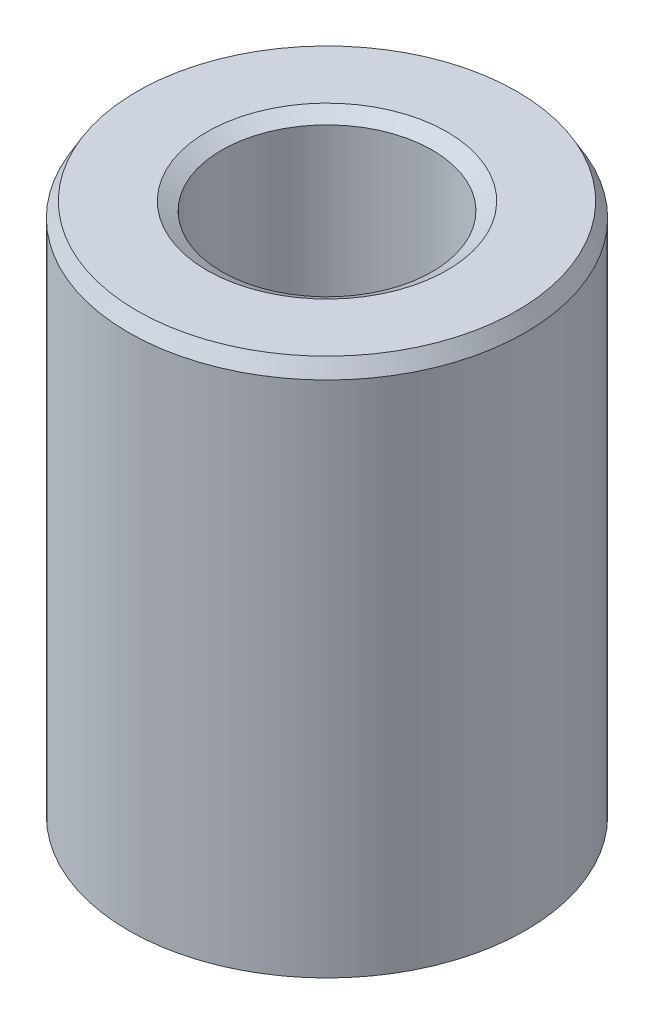
ISO-10303-21;
HEADER;
FILE_DESCRIPTION(('STEP AP214'),'2;1');
FILE_NAME('part.step','',(''),(''),'','','');
FILE_SCHEMA(('AUTOMOTIVE_DESIGN { 1 0 10303 214 1 1 1 1 }'));
ENDSEC;
DATA;
#1=APPLICATION_CONTEXT('core data for automotive mechanical design processes');
#2=APPLICATION_PROTOCOL_DEFINITION('international standard','automotive_design',2000,#1);
#3=PRODUCT_CONTEXT('',#1,'mechanical');
#4=PRODUCT('Part','Part','',(#3));
#5=PRODUCT_RELATED_PRODUCT_CATEGORY('part','',(#4));
#6=PRODUCT_DEFINITION_FORMATION('','',#4);
#7=PRODUCT_DEFINITION_CONTEXT('part definition',#1,'design');
#8=PRODUCT_DEFINITION('design','',#6,#7);
#9=PRODUCT_DEFINITION_SHAPE('','',#8);
#10=(LENGTH_UNIT() NAMED_UNIT(*) SI_UNIT(.MILLI.,.METRE.));
#11=(NAMED_UNIT(*) PLANE_ANGLE_UNIT() SI_UNIT($,.RADIAN.));
#12=(NAMED_UNIT(*) SI_UNIT($,.STERADIAN.) SOLID_ANGLE_UNIT());
#13=UNCERTAINTY_MEASURE_WITH_UNIT(LENGTH_MEASURE(1.E-05),#10,'distance_accuracy_value','');
#14=(GEOMETRIC_REPRESENTATION_CONTEXT(3) GLOBAL_UNCERTAINTY_ASSIGNED_CONTEXT((#13)) GLOBAL_UNIT_ASSIGNED_CONTEXT((#10,
#11,#12)) REPRESENTATION_CONTEXT('',''));
#15=CARTESIAN_POINT('',(0.,0.,0.));
#16=DIRECTION('',(0.,0.,1.));
#17=DIRECTION('',(1.,0.,0.));
#18=AXIS2_PLACEMENT_3D('',#15,#16,#17);
#19=CARTESIAN_POINT('',(0.,20.4448372051273,0.));
#20=DIRECTION('',(0.,-1.,0.));
#21=DIRECTION('',(0.,0.,-1.));
#22=AXIS2_PLACEMENT_3D('',#19,#20,#21);
#23=CYLINDRICAL_SURFACE('',#22,7.5);
#24=CARTESIAN_POINT('',(0.,0.319921037343789,0.));
#25=DIRECTION('',(0.,1.,0.));
#26=DIRECTION('',(0.,0.,1.));
#27=AXIS2_PLACEMENT_3D('',#24,#25,#26);
#28=CIRCLE('',#27,7.5);
#29=CARTESIAN_POINT('',(0.,0.319921037343789,7.5));
#30=VERTEX_POINT('',#29);
#31=EDGE_CURVE('E10',#30,#30,#28,.T.);
#32=ORIENTED_EDGE('',*,*,#31,.T.);
#33=EDGE_LOOP('',(#32));
#34=FACE_BOUND('',#33,.T.);
#35=CARTESIAN_POINT('',(0.,19.8907177140377,0.));
#36=DIRECTION('',(0.,1.,0.));
#37=DIRECTION('',(0.,0.,1.));
#38=AXIS2_PLACEMENT_3D('',#35,#36,#37);
#39=CIRCLE('',#38,7.5);
#40=CARTESIAN_POINT('',(0.,19.8907177140377,7.5));
#41=VERTEX_POINT('',#40);
#42=EDGE_CURVE('E50',#41,#41,#39,.F.);
#43=ORIENTED_EDGE('',*,*,#42,.T.);
#44=EDGE_LOOP('',(#43));
#45=FACE_BOUND('',#44,.T.);
#46=ADVANCED_FACE('F39',(#34,#45),#23,.T.);
#47=CARTESIAN_POINT('',(0.,20.4448372051273,0.));
#48=DIRECTION('',(0.,1.,0.));
#49=DIRECTION('',(0.,0.,1.));
#50=AXIS2_PLACEMENT_3D('',#47,#48,#49);
#51=PLANE('',#50);
#52=CARTESIAN_POINT('',(0.,20.4448372051273,0.));
#53=DIRECTION('',(0.,1.,0.));
#54=DIRECTION('',(0.,0.,1.));
#55=AXIS2_PLACEMENT_3D('',#52,#53,#54);
#56=CIRCLE('',#55,4.53543100763398);
#57=CARTESIAN_POINT('',(0.,20.4448372051273,4.53543100763398));
#58=VERTEX_POINT('',#57);
#59=EDGE_CURVE('E58',#58,#58,#56,.F.);
#60=ORIENTED_EDGE('',*,*,#59,.T.);
#61=EDGE_LOOP('',(#60));
#62=FACE_BOUND('',#61,.T.);
#63=CARTESIAN_POINT('',(0.,20.4448372051273,0.));
#64=DIRECTION('',(0.,1.,0.));
#65=DIRECTION('',(0.,0.,1.));
#66=AXIS2_PLACEMENT_3D('',#63,#64,#65);
#67=CIRCLE('',#66,7.1800789626562);
#68=CARTESIAN_POINT('',(0.,20.4448372051273,7.1800789626562));
#69=VERTEX_POINT('',#68);
#70=EDGE_CURVE('E61',#69,#69,#67,.T.);
#71=ORIENTED_EDGE('',*,*,#70,.T.);
#72=EDGE_LOOP('',(#71));
#73=FACE_BOUND('',#72,.T.);
#74=ADVANCED_FACE('F88',(#62,#73),#51,.T.);
#75=CARTESIAN_POINT('',(0.,0.,0.));
#76=DIRECTION('',(0.,1.,0.));
#77=DIRECTION('',(0.,0.,1.));
#78=AXIS2_PLACEMENT_3D('',#75,#76,#77);
#79=PLANE('',#78);
#80=CARTESIAN_POINT('',(0.,0.,0.));
#81=DIRECTION('',(0.,1.,0.));
#82=DIRECTION('',(0.,0.,1.));
#83=AXIS2_PLACEMENT_3D('',#80,#81,#82);
#84=CIRCLE('',#83,4.30123255388818);
#85=CARTESIAN_POINT('',(0.,0.,4.30123255388818));
#86=VERTEX_POINT('',#85);
#87=EDGE_CURVE('E51',#86,#86,#84,.T.);
#88=ORIENTED_EDGE('',*,*,#87,.T.);
#89=EDGE_LOOP('',(#88));
#90=FACE_BOUND('',#89,.T.);
#91=CARTESIAN_POINT('',(0.,0.,0.));
#92=DIRECTION('',(0.,1.,0.));
#93=DIRECTION('',(0.,0.,1.));
#94=AXIS2_PLACEMENT_3D('',#91,#92,#93);
#95=CIRCLE('',#94,6.94588050891041);
#96=CARTESIAN_POINT('',(0.,0.,6.94588050891041));
#97=VERTEX_POINT('',#96);
#98=EDGE_CURVE('E54',#97,#97,#95,.F.);
#99=ORIENTED_EDGE('',*,*,#98,.T.);
#100=EDGE_LOOP('',(#99));
#101=FACE_BOUND('',#100,.T.);
#102=ADVANCED_FACE('F83',(#90,#101),#79,.F.);
#103=CARTESIAN_POINT('',(0.,20.4448372051273,0.));
#104=DIRECTION('',(0.,-1.,0.));
#105=DIRECTION('',(0.,0.,-1.));
#106=AXIS2_PLACEMENT_3D('',#103,#104,#105);
#107=CYLINDRICAL_SURFACE('',#106,3.98131151654439);
#108=CARTESIAN_POINT('',(0.,20.1249161677835,0.));
#109=DIRECTION('',(0.,1.,0.));
#110=DIRECTION('',(0.,0.,1.));
#111=AXIS2_PLACEMENT_3D('',#108,#109,#110);
#112=CIRCLE('',#111,3.98131151654439);
#113=CARTESIAN_POINT('',(0.,20.1249161677835,3.98131151654439));
#114=VERTEX_POINT('',#113);
#115=EDGE_CURVE('E67',#114,#114,#112,.T.);
#116=ORIENTED_EDGE('',*,*,#115,.T.);
#117=EDGE_LOOP('',(#116));
#118=FACE_BOUND('',#117,.T.);
#119=CARTESIAN_POINT('',(0.,0.554119491089584,0.));
#120=DIRECTION('',(0.,1.,0.));
#121=DIRECTION('',(0.,0.,1.));
#122=AXIS2_PLACEMENT_3D('',#119,#120,#121);
#123=CIRCLE('',#122,3.98131151654439);
#124=CARTESIAN_POINT('',(0.,0.554119491089584,3.98131151654439));
#125=VERTEX_POINT('',#124);
#126=EDGE_CURVE('E69',#125,#125,#123,.F.);
#127=ORIENTED_EDGE('',*,*,#126,.T.);
#128=EDGE_LOOP('',(#127));
#129=FACE_BOUND('',#128,.T.);
#130=ADVANCED_FACE('F71',(#118,#129),#107,.F.);
#131=CARTESIAN_POINT('',(0.,20.1249161677835,0.));
#132=DIRECTION('',(0.,1.,0.));
#133=DIRECTION('',(0.,0.,1.));
#134=AXIS2_PLACEMENT_3D('',#131,#132,#133);
#135=CONICAL_SURFACE('',#134,3.98131151654439,1.0471975511966);
#136=ORIENTED_EDGE('',*,*,#59,.F.);
#137=EDGE_LOOP('',(#136));
#138=FACE_BOUND('',#137,.T.);
#139=ORIENTED_EDGE('',*,*,#115,.F.);
#140=EDGE_LOOP('',(#139));
#141=FACE_BOUND('',#140,.T.);
#142=ADVANCED_FACE('F77',(#138,#141),#135,.F.);
#143=CARTESIAN_POINT('',(0.,0.,0.));
#144=DIRECTION('',(0.,-1.,0.));
#145=DIRECTION('',(0.,0.,-1.));
#146=AXIS2_PLACEMENT_3D('',#143,#144,#145);
#147=CONICAL_SURFACE('',#146,4.30123255388818,0.523598775598297);
#148=ORIENTED_EDGE('',*,*,#126,.F.);
#149=EDGE_LOOP('',(#148));
#150=FACE_BOUND('',#149,.T.);
#151=ORIENTED_EDGE('',*,*,#87,.F.);
#152=EDGE_LOOP('',(#151));
#153=FACE_BOUND('',#152,.T.);
#154=ADVANCED_FACE('F73',(#150,#153),#147,.F.);
#155=CARTESIAN_POINT('',(0.,0.319921037343789,0.));
#156=DIRECTION('',(0.,1.,0.));
#157=DIRECTION('',(0.,0.,1.));
#158=AXIS2_PLACEMENT_3D('',#155,#156,#157);
#159=CONICAL_SURFACE('',#158,7.5,1.0471975511966);
#160=ORIENTED_EDGE('',*,*,#98,.F.);
#161=EDGE_LOOP('',(#160));
#162=FACE_BOUND('',#161,.T.);
#163=ORIENTED_EDGE('',*,*,#31,.F.);
#164=EDGE_LOOP('',(#163));
#165=FACE_BOUND('',#164,.T.);
#166=ADVANCED_FACE('F76',(#162,#165),#159,.T.);
#167=CARTESIAN_POINT('',(0.,20.4448372051273,0.));
#168=DIRECTION('',(0.,-1.,0.));
#169=DIRECTION('',(0.,0.,-1.));
#170=AXIS2_PLACEMENT_3D('',#167,#168,#169);
#171=CONICAL_SURFACE('',#170,7.1800789626562,0.523598775598293);
#172=ORIENTED_EDGE('',*,*,#42,.F.);
#173=EDGE_LOOP('',(#172));
#174=FACE_BOUND('',#173,.T.);
#175=ORIENTED_EDGE('',*,*,#70,.F.);
#176=EDGE_LOOP('',(#175));
#177=FACE_BOUND('',#176,.T.);
#178=ADVANCED_FACE('F45',(#174,#177),#171,.T.);
#179=CLOSED_SHELL('',(#46,#74,#102,#130,#142,#154,#166,#178));
#180=MANIFOLD_SOLID_BREP('B2',#179);
#181=ADVANCED_BREP_SHAPE_REPRESENTATION('',(#18,#180),#14);
#182=SHAPE_DEFINITION_REPRESENTATION(#9,#181);
ENDSEC;
END-ISO-10303-21;
